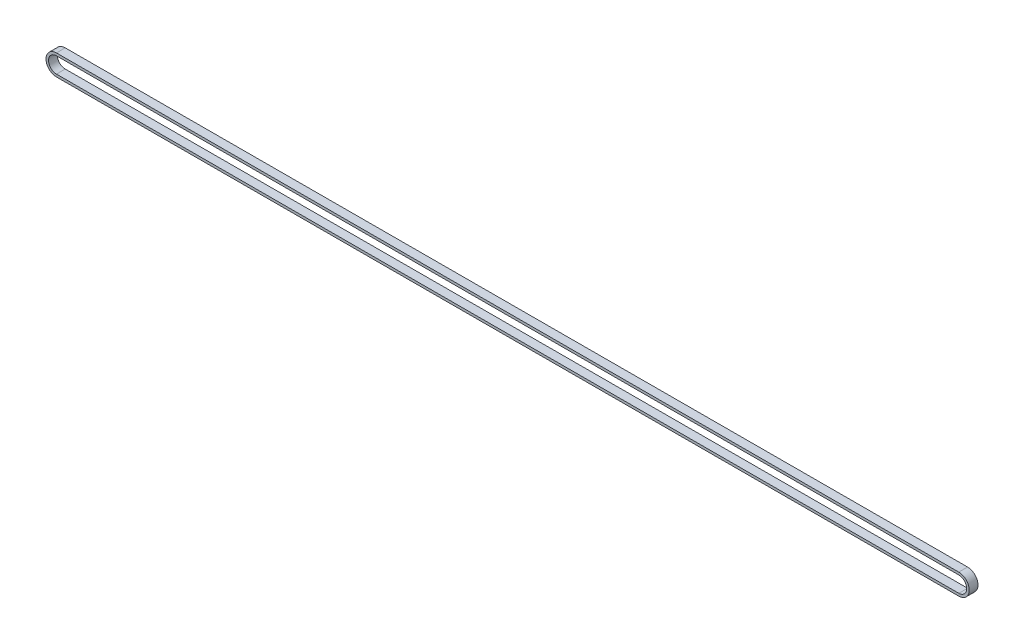
ISO-10303-21;
HEADER;
FILE_DESCRIPTION(('STEP AP214'),'2;1');
FILE_NAME('part.step','',(''),(''),'','','');
FILE_SCHEMA(('AUTOMOTIVE_DESIGN { 1 0 10303 214 1 1 1 1 }'));
ENDSEC;
DATA;
#1=APPLICATION_CONTEXT('core data for automotive mechanical design processes');
#2=APPLICATION_PROTOCOL_DEFINITION('international standard','automotive_design',2000,#1);
#3=PRODUCT_CONTEXT('',#1,'mechanical');
#4=PRODUCT('Part','Part','',(#3));
#5=PRODUCT_RELATED_PRODUCT_CATEGORY('part','',(#4));
#6=PRODUCT_DEFINITION_FORMATION('','',#4);
#7=PRODUCT_DEFINITION_CONTEXT('part definition',#1,'design');
#8=PRODUCT_DEFINITION('design','',#6,#7);
#9=PRODUCT_DEFINITION_SHAPE('','',#8);
#10=(LENGTH_UNIT() NAMED_UNIT(*) SI_UNIT(.MILLI.,.METRE.));
#11=(NAMED_UNIT(*) PLANE_ANGLE_UNIT() SI_UNIT($,.RADIAN.));
#12=(NAMED_UNIT(*) SI_UNIT($,.STERADIAN.) SOLID_ANGLE_UNIT());
#13=UNCERTAINTY_MEASURE_WITH_UNIT(LENGTH_MEASURE(1.E-05),#10,'distance_accuracy_value','');
#14=(GEOMETRIC_REPRESENTATION_CONTEXT(3) GLOBAL_UNCERTAINTY_ASSIGNED_CONTEXT((#13)) GLOBAL_UNIT_ASSIGNED_CONTEXT((#10,
#11,#12)) REPRESENTATION_CONTEXT('',''));
#15=CARTESIAN_POINT('',(0.,0.,0.));
#16=DIRECTION('',(0.,0.,1.));
#17=DIRECTION('',(1.,0.,0.));
#18=AXIS2_PLACEMENT_3D('',#15,#16,#17);
#19=CARTESIAN_POINT('',(0.00106411523859151,-1.23699776073138,3.5));
#20=DIRECTION('',(0.,0.,-1.));
#21=DIRECTION('',(-1.,0.,0.));
#22=AXIS2_PLACEMENT_3D('',#19,#20,#21);
#23=CYLINDRICAL_SURFACE('',#22,8.305);
#24=CARTESIAN_POINT('',(0.00106411523859151,-1.23699776073138,-3.5));
#25=DIRECTION('',(0.,0.,-1.));
#26=DIRECTION('',(-1.,0.,0.));
#27=AXIS2_PLACEMENT_3D('',#24,#25,#26);
#28=CIRCLE('',#27,8.305);
#29=CARTESIAN_POINT('',(0.015352385045464,-9.54198546965341,-3.5));
#30=VERTEX_POINT('',#29);
#31=CARTESIAN_POINT('',(-0.0132241545685707,7.06798994819064,-3.5));
#32=VERTEX_POINT('',#31);
#33=EDGE_CURVE('E157',#30,#32,#28,.T.);
#34=ORIENTED_EDGE('',*,*,#33,.F.);
#35=DIRECTION('',(0.,0.,-1.));
#36=VECTOR('',#35,1.);
#37=CARTESIAN_POINT('',(0.015352385045464,-9.54198546965341,3.5));
#38=LINE('',#37,#36);
#39=CARTESIAN_POINT('',(0.015352385045464,-9.54198546965341,3.5));
#40=VERTEX_POINT('',#39);
#41=EDGE_CURVE('E12',#40,#30,#38,.T.);
#42=ORIENTED_EDGE('',*,*,#41,.F.);
#43=CARTESIAN_POINT('',(0.00106411523859151,-1.23699776073138,3.5));
#44=DIRECTION('',(0.,0.,-1.));
#45=DIRECTION('',(-1.,0.,0.));
#46=AXIS2_PLACEMENT_3D('',#43,#44,#45);
#47=CIRCLE('',#46,8.305);
#48=CARTESIAN_POINT('',(-0.0132241545685707,7.06798994819064,3.5));
#49=VERTEX_POINT('',#48);
#50=EDGE_CURVE('E161',#40,#49,#47,.T.);
#51=ORIENTED_EDGE('',*,*,#50,.T.);
#52=DIRECTION('',(0.,0.,-1.));
#53=VECTOR('',#52,1.);
#54=CARTESIAN_POINT('',(-0.0132241545685707,7.06798994819064,3.5));
#55=LINE('',#54,#53);
#56=EDGE_CURVE('E62',#49,#32,#55,.T.);
#57=ORIENTED_EDGE('',*,*,#56,.T.);
#58=EDGE_LOOP('',(#34,#42,#51,#57));
#59=FACE_BOUND('',#58,.T.);
#60=ADVANCED_FACE('F59',(#59),#23,.T.);
#61=CARTESIAN_POINT('',(0.0153523850457535,-9.54198546965341,3.5));
#62=DIRECTION('',(0.00172044187924888,-0.999998520038775,0.));
#63=DIRECTION('',(0.999998520038775,0.00172044187924888,0.));
#64=AXIS2_PLACEMENT_3D('',#61,#62,#63);
#65=PLANE('',#64);
#66=DIRECTION('',(-0.999998520038775,-0.00172044187924888,0.));
#67=VECTOR('',#66,1.);
#68=CARTESIAN_POINT('',(0.0153523850457535,-9.54198546965341,-3.5));
#69=LINE('',#68,#67);
#70=CARTESIAN_POINT('',(719.014288265026,-8.30498775852146,-3.5));
#71=VERTEX_POINT('',#70);
#72=EDGE_CURVE('E165',#71,#30,#69,.T.);
#73=ORIENTED_EDGE('',*,*,#72,.F.);
#74=DIRECTION('',(0.,0.,-1.));
#75=VECTOR('',#74,1.);
#76=CARTESIAN_POINT('',(719.014288265026,-8.30498775852146,3.5));
#77=LINE('',#76,#75);
#78=CARTESIAN_POINT('',(719.014288265026,-8.30498775852146,3.5));
#79=VERTEX_POINT('',#78);
#80=EDGE_CURVE('E67',#79,#71,#77,.T.);
#81=ORIENTED_EDGE('',*,*,#80,.F.);
#82=DIRECTION('',(-0.999998520038775,-0.00172044187924888,0.));
#83=VECTOR('',#82,1.);
#84=CARTESIAN_POINT('',(0.0153523850457535,-9.54198546965341,3.5));
#85=LINE('',#84,#83);
#86=EDGE_CURVE('E171',#79,#40,#85,.T.);
#87=ORIENTED_EDGE('',*,*,#86,.T.);
#88=ORIENTED_EDGE('',*,*,#41,.T.);
#89=EDGE_LOOP('',(#73,#81,#87,#88));
#90=FACE_BOUND('',#89,.T.);
#91=ADVANCED_FACE('F197',(#90),#65,.T.);
#92=CARTESIAN_POINT('',(718.999999995219,-4.95994356697338E-08,3.5));
#93=DIRECTION('',(0.,0.,-1.));
#94=DIRECTION('',(-1.,0.,0.));
#95=AXIS2_PLACEMENT_3D('',#92,#93,#94);
#96=CYLINDRICAL_SURFACE('',#95,8.305);
#97=CARTESIAN_POINT('',(718.999999995219,-4.95994356697338E-08,-3.5));
#98=DIRECTION('',(0.,0.,-1.));
#99=DIRECTION('',(-1.,0.,0.));
#100=AXIS2_PLACEMENT_3D('',#97,#98,#99);
#101=CIRCLE('',#100,8.305);
#102=CARTESIAN_POINT('',(718.985711725412,8.30498765932259,-3.5));
#103=VERTEX_POINT('',#102);
#104=EDGE_CURVE('E179',#103,#71,#101,.T.);
#105=ORIENTED_EDGE('',*,*,#104,.F.);
#106=DIRECTION('',(0.,0.,-1.));
#107=VECTOR('',#106,1.);
#108=CARTESIAN_POINT('',(718.985711725412,8.30498765932259,3.5));
#109=LINE('',#108,#107);
#110=CARTESIAN_POINT('',(718.985711725412,8.30498765932259,3.5));
#111=VERTEX_POINT('',#110);
#112=EDGE_CURVE('E184',#111,#103,#109,.T.);
#113=ORIENTED_EDGE('',*,*,#112,.F.);
#114=CARTESIAN_POINT('',(718.999999995219,-4.95994356697338E-08,3.5));
#115=DIRECTION('',(0.,0.,-1.));
#116=DIRECTION('',(-1.,0.,0.));
#117=AXIS2_PLACEMENT_3D('',#114,#115,#116);
#118=CIRCLE('',#117,8.305);
#119=EDGE_CURVE('E168',#111,#79,#118,.T.);
#120=ORIENTED_EDGE('',*,*,#119,.T.);
#121=ORIENTED_EDGE('',*,*,#80,.T.);
#122=EDGE_LOOP('',(#105,#113,#120,#121));
#123=FACE_BOUND('',#122,.T.);
#124=ADVANCED_FACE('F201',(#123),#96,.T.);
#125=CARTESIAN_POINT('',(-0.0132241545685705,7.06798994819064,3.5));
#126=DIRECTION('',(-0.00172044187924888,0.999998520038775,0.));
#127=DIRECTION('',(-0.999998520038775,-0.00172044187924888,0.));
#128=AXIS2_PLACEMENT_3D('',#125,#126,#127);
#129=PLANE('',#128);
#130=DIRECTION('',(0.999998520038775,0.00172044187924888,0.));
#131=VECTOR('',#130,1.);
#132=CARTESIAN_POINT('',(-0.0132241545685705,7.06798994819064,-3.5));
#133=LINE('',#132,#131);
#134=EDGE_CURVE('E176',#32,#103,#133,.T.);
#135=ORIENTED_EDGE('',*,*,#134,.F.);
#136=ORIENTED_EDGE('',*,*,#56,.F.);
#137=DIRECTION('',(0.999998520038775,0.00172044187924888,0.));
#138=VECTOR('',#137,1.);
#139=CARTESIAN_POINT('',(-0.0132241545685705,7.06798994819064,3.5));
#140=LINE('',#139,#138);
#141=EDGE_CURVE('E164',#49,#111,#140,.T.);
#142=ORIENTED_EDGE('',*,*,#141,.T.);
#143=ORIENTED_EDGE('',*,*,#112,.T.);
#144=EDGE_LOOP('',(#135,#136,#142,#143));
#145=FACE_BOUND('',#144,.T.);
#146=ADVANCED_FACE('F192',(#145),#129,.T.);
#147=CARTESIAN_POINT('',(0.00106411523859151,-1.23699776073138,3.5));
#148=DIRECTION('',(0.,0.,-1.));
#149=DIRECTION('',(-1.,0.,0.));
#150=AXIS2_PLACEMENT_3D('',#147,#148,#149);
#151=PLANE('',#150);
#152=DIRECTION('',(-0.999998520038775,-0.00172044187924888,0.));
#153=VECTOR('',#152,1.);
#154=CARTESIAN_POINT('',(719.010847381268,-6.30499071844391,3.5));
#155=LINE('',#154,#153);
#156=CARTESIAN_POINT('',(719.010847381268,-6.30499071844391,3.5));
#157=VERTEX_POINT('',#156);
#158=CARTESIAN_POINT('',(0.0119115012872557,-7.54198842957586,3.5));
#159=VERTEX_POINT('',#158);
#160=EDGE_CURVE('E132',#157,#159,#155,.T.);
#161=ORIENTED_EDGE('',*,*,#160,.T.);
#162=CARTESIAN_POINT('',(0.00106411523859151,-1.23699776073138,3.5));
#163=DIRECTION('',(0.,0.,-1.));
#164=DIRECTION('',(-1.,0.,0.));
#165=AXIS2_PLACEMENT_3D('',#162,#163,#164);
#166=CIRCLE('',#165,6.305);
#167=CARTESIAN_POINT('',(-0.00978327081007269,5.06799290811309,3.5));
#168=VERTEX_POINT('',#167);
#169=EDGE_CURVE('E126',#159,#168,#166,.T.);
#170=ORIENTED_EDGE('',*,*,#169,.T.);
#171=DIRECTION('',(0.999998520038775,0.00172044187924888,0.));
#172=VECTOR('',#171,1.);
#173=CARTESIAN_POINT('',(-0.00978327081007269,5.06799290811309,3.5));
#174=LINE('',#173,#172);
#175=CARTESIAN_POINT('',(718.989152609171,6.30499061924504,3.5));
#176=VERTEX_POINT('',#175);
#177=EDGE_CURVE('E135',#168,#176,#174,.T.);
#178=ORIENTED_EDGE('',*,*,#177,.T.);
#179=CARTESIAN_POINT('',(718.999999995219,-4.95994356697338E-08,3.5));
#180=DIRECTION('',(0.,0.,-1.));
#181=DIRECTION('',(-1.,0.,0.));
#182=AXIS2_PLACEMENT_3D('',#179,#180,#181);
#183=CIRCLE('',#182,6.305);
#184=EDGE_CURVE('E75',#176,#157,#183,.T.);
#185=ORIENTED_EDGE('',*,*,#184,.T.);
#186=EDGE_LOOP('',(#161,#170,#178,#185));
#187=FACE_BOUND('',#186,.T.);
#188=ORIENTED_EDGE('',*,*,#50,.F.);
#189=ORIENTED_EDGE('',*,*,#86,.F.);
#190=ORIENTED_EDGE('',*,*,#119,.F.);
#191=ORIENTED_EDGE('',*,*,#141,.F.);
#192=EDGE_LOOP('',(#188,#189,#190,#191));
#193=FACE_BOUND('',#192,.T.);
#194=ADVANCED_FACE('F139',(#187,#193),#151,.F.);
#195=CARTESIAN_POINT('',(0.00106411523859151,-1.23699776073138,-3.5));
#196=DIRECTION('',(0.,0.,-1.));
#197=DIRECTION('',(-1.,0.,0.));
#198=AXIS2_PLACEMENT_3D('',#195,#196,#197);
#199=PLANE('',#198);
#200=CARTESIAN_POINT('',(0.00106411523859151,-1.23699776073138,-3.5));
#201=DIRECTION('',(0.,0.,-1.));
#202=DIRECTION('',(-1.,0.,0.));
#203=AXIS2_PLACEMENT_3D('',#200,#201,#202);
#204=CIRCLE('',#203,6.305);
#205=CARTESIAN_POINT('',(0.0119115012872557,-7.54198842957586,-3.5));
#206=VERTEX_POINT('',#205);
#207=CARTESIAN_POINT('',(-0.00978327081007269,5.06799290811309,-3.5));
#208=VERTEX_POINT('',#207);
#209=EDGE_CURVE('E83',#206,#208,#204,.T.);
#210=ORIENTED_EDGE('',*,*,#209,.F.);
#211=DIRECTION('',(-0.999998520038775,-0.00172044187924888,0.));
#212=VECTOR('',#211,1.);
#213=CARTESIAN_POINT('',(719.010847381268,-6.30499071844391,-3.5));
#214=LINE('',#213,#212);
#215=CARTESIAN_POINT('',(719.010847381268,-6.30499071844391,-3.5));
#216=VERTEX_POINT('',#215);
#217=EDGE_CURVE('E142',#216,#206,#214,.T.);
#218=ORIENTED_EDGE('',*,*,#217,.F.);
#219=CARTESIAN_POINT('',(718.999999995219,-4.95994356697338E-08,-3.5));
#220=DIRECTION('',(0.,0.,-1.));
#221=DIRECTION('',(-1.,0.,0.));
#222=AXIS2_PLACEMENT_3D('',#219,#220,#221);
#223=CIRCLE('',#222,6.305);
#224=CARTESIAN_POINT('',(718.989152609171,6.30499061924504,-3.5));
#225=VERTEX_POINT('',#224);
#226=EDGE_CURVE('E145',#225,#216,#223,.T.);
#227=ORIENTED_EDGE('',*,*,#226,.F.);
#228=DIRECTION('',(0.999998520038775,0.00172044187924888,0.));
#229=VECTOR('',#228,1.);
#230=CARTESIAN_POINT('',(-0.00978327081007269,5.06799290811309,-3.5));
#231=LINE('',#230,#229);
#232=EDGE_CURVE('E151',#208,#225,#231,.T.);
#233=ORIENTED_EDGE('',*,*,#232,.F.);
#234=EDGE_LOOP('',(#210,#218,#227,#233));
#235=FACE_BOUND('',#234,.T.);
#236=ORIENTED_EDGE('',*,*,#33,.T.);
#237=ORIENTED_EDGE('',*,*,#134,.T.);
#238=ORIENTED_EDGE('',*,*,#104,.T.);
#239=ORIENTED_EDGE('',*,*,#72,.T.);
#240=EDGE_LOOP('',(#236,#237,#238,#239));
#241=FACE_BOUND('',#240,.T.);
#242=ADVANCED_FACE('F194',(#235,#241),#199,.T.);
#243=CARTESIAN_POINT('',(0.00106411523859151,-1.23699776073138,3.5));
#244=DIRECTION('',(0.,0.,-1.));
#245=DIRECTION('',(-1.,0.,0.));
#246=AXIS2_PLACEMENT_3D('',#243,#244,#245);
#247=CYLINDRICAL_SURFACE('',#246,6.305);
#248=ORIENTED_EDGE('',*,*,#209,.T.);
#249=DIRECTION('',(0.,0.,-1.));
#250=VECTOR('',#249,1.);
#251=CARTESIAN_POINT('',(-0.00978327081007269,5.06799290811309,3.5));
#252=LINE('',#251,#250);
#253=EDGE_CURVE('E122',#168,#208,#252,.T.);
#254=ORIENTED_EDGE('',*,*,#253,.F.);
#255=ORIENTED_EDGE('',*,*,#169,.F.);
#256=DIRECTION('',(0.,0.,-1.));
#257=VECTOR('',#256,1.);
#258=CARTESIAN_POINT('',(0.0119115012872557,-7.54198842957586,3.5));
#259=LINE('',#258,#257);
#260=EDGE_CURVE('E155',#159,#206,#259,.T.);
#261=ORIENTED_EDGE('',*,*,#260,.T.);
#262=EDGE_LOOP('',(#248,#254,#255,#261));
#263=FACE_BOUND('',#262,.T.);
#264=ADVANCED_FACE('F124',(#263),#247,.F.);
#265=CARTESIAN_POINT('',(719.010847381268,-6.30499071844391,3.5));
#266=DIRECTION('',(0.00172044187924888,-0.999998520038775,0.));
#267=DIRECTION('',(0.999998520038775,0.00172044187924888,0.));
#268=AXIS2_PLACEMENT_3D('',#265,#266,#267);
#269=PLANE('',#268);
#270=ORIENTED_EDGE('',*,*,#217,.T.);
#271=ORIENTED_EDGE('',*,*,#260,.F.);
#272=ORIENTED_EDGE('',*,*,#160,.F.);
#273=DIRECTION('',(0.,0.,-1.));
#274=VECTOR('',#273,1.);
#275=CARTESIAN_POINT('',(719.010847381268,-6.30499071844391,3.5));
#276=LINE('',#275,#274);
#277=EDGE_CURVE('E158',#157,#216,#276,.T.);
#278=ORIENTED_EDGE('',*,*,#277,.T.);
#279=EDGE_LOOP('',(#270,#271,#272,#278));
#280=FACE_BOUND('',#279,.T.);
#281=ADVANCED_FACE('F252',(#280),#269,.F.);
#282=CARTESIAN_POINT('',(718.999999995219,-4.95994356697338E-08,3.5));
#283=DIRECTION('',(0.,0.,-1.));
#284=DIRECTION('',(-1.,0.,0.));
#285=AXIS2_PLACEMENT_3D('',#282,#283,#284);
#286=CYLINDRICAL_SURFACE('',#285,6.305);
#287=ORIENTED_EDGE('',*,*,#226,.T.);
#288=ORIENTED_EDGE('',*,*,#277,.F.);
#289=ORIENTED_EDGE('',*,*,#184,.F.);
#290=DIRECTION('',(0.,0.,-1.));
#291=VECTOR('',#290,1.);
#292=CARTESIAN_POINT('',(718.989152609171,6.30499061924504,3.5));
#293=LINE('',#292,#291);
#294=EDGE_CURVE('E131',#176,#225,#293,.T.);
#295=ORIENTED_EDGE('',*,*,#294,.T.);
#296=EDGE_LOOP('',(#287,#288,#289,#295));
#297=FACE_BOUND('',#296,.T.);
#298=ADVANCED_FACE('F261',(#297),#286,.F.);
#299=CARTESIAN_POINT('',(-0.00978327081007269,5.06799290811309,3.5));
#300=DIRECTION('',(-0.00172044187924888,0.999998520038775,0.));
#301=DIRECTION('',(-0.999998520038775,-0.00172044187924888,0.));
#302=AXIS2_PLACEMENT_3D('',#299,#300,#301);
#303=PLANE('',#302);
#304=ORIENTED_EDGE('',*,*,#232,.T.);
#305=ORIENTED_EDGE('',*,*,#294,.F.);
#306=ORIENTED_EDGE('',*,*,#177,.F.);
#307=ORIENTED_EDGE('',*,*,#253,.T.);
#308=EDGE_LOOP('',(#304,#305,#306,#307));
#309=FACE_BOUND('',#308,.T.);
#310=ADVANCED_FACE('F136',(#309),#303,.F.);
#311=CLOSED_SHELL('',(#60,#91,#124,#146,#194,#242,#264,#281,#298,#310));
#312=MANIFOLD_SOLID_BREP('B2',#311);
#313=ADVANCED_BREP_SHAPE_REPRESENTATION('',(#18,#312),#14);
#314=SHAPE_DEFINITION_REPRESENTATION(#9,#313);
ENDSEC;
END-ISO-10303-21;
